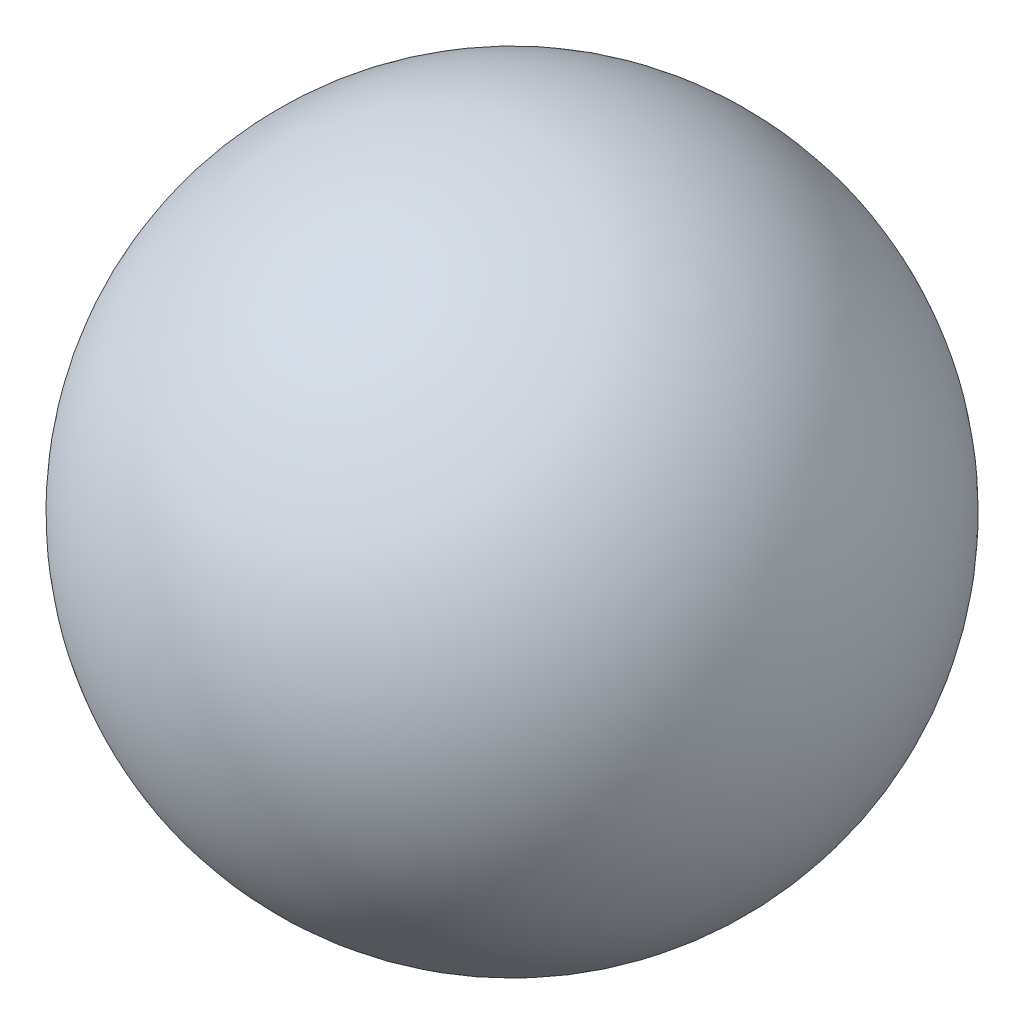
ISO-10303-21;
HEADER;
FILE_DESCRIPTION(('STEP AP214'),'2;1');
FILE_NAME('part.step','',(''),(''),'','','');
FILE_SCHEMA(('AUTOMOTIVE_DESIGN { 1 0 10303 214 1 1 1 1 }'));
ENDSEC;
DATA;
#1=APPLICATION_CONTEXT('core data for automotive mechanical design processes');
#2=APPLICATION_PROTOCOL_DEFINITION('international standard','automotive_design',2000,#1);
#3=PRODUCT_CONTEXT('',#1,'mechanical');
#4=PRODUCT('Part','Part','',(#3));
#5=PRODUCT_RELATED_PRODUCT_CATEGORY('part','',(#4));
#6=PRODUCT_DEFINITION_FORMATION('','',#4);
#7=PRODUCT_DEFINITION_CONTEXT('part definition',#1,'design');
#8=PRODUCT_DEFINITION('design','',#6,#7);
#9=PRODUCT_DEFINITION_SHAPE('','',#8);
#10=(LENGTH_UNIT() NAMED_UNIT(*) SI_UNIT(.MILLI.,.METRE.));
#11=(NAMED_UNIT(*) PLANE_ANGLE_UNIT() SI_UNIT($,.RADIAN.));
#12=(NAMED_UNIT(*) SI_UNIT($,.STERADIAN.) SOLID_ANGLE_UNIT());
#13=UNCERTAINTY_MEASURE_WITH_UNIT(LENGTH_MEASURE(1.E-05),#10,'distance_accuracy_value','');
#14=(GEOMETRIC_REPRESENTATION_CONTEXT(3) GLOBAL_UNCERTAINTY_ASSIGNED_CONTEXT((#13)) GLOBAL_UNIT_ASSIGNED_CONTEXT((#10,
#11,#12)) REPRESENTATION_CONTEXT('',''));
#15=CARTESIAN_POINT('',(0.,0.,0.));
#16=DIRECTION('',(0.,0.,1.));
#17=DIRECTION('',(1.,0.,0.));
#18=AXIS2_PLACEMENT_3D('',#15,#16,#17);
#19=CARTESIAN_POINT('',(0.,0.,-30.));
#20=DIRECTION('',(0.,0.,1.));
#21=DIRECTION('',(-1.,0.,0.));
#22=AXIS2_PLACEMENT_3D('',#19,#20,#21);
#23=SPHERICAL_SURFACE('',#22,30.);
#24=CARTESIAN_POINT('',(0.,0.,0.));
#25=VERTEX_POINT('',#24);
#26=VERTEX_LOOP('',#25);
#27=FACE_BOUND('',#26,.T.);
#28=ADVANCED_FACE('F34',(#27),#23,.T.);
#29=CLOSED_SHELL('',(#28));
#30=MANIFOLD_SOLID_BREP('B2',#29);
#31=ADVANCED_BREP_SHAPE_REPRESENTATION('',(#18,#30),#14);
#32=SHAPE_DEFINITION_REPRESENTATION(#9,#31);
ENDSEC;
END-ISO-10303-21;
